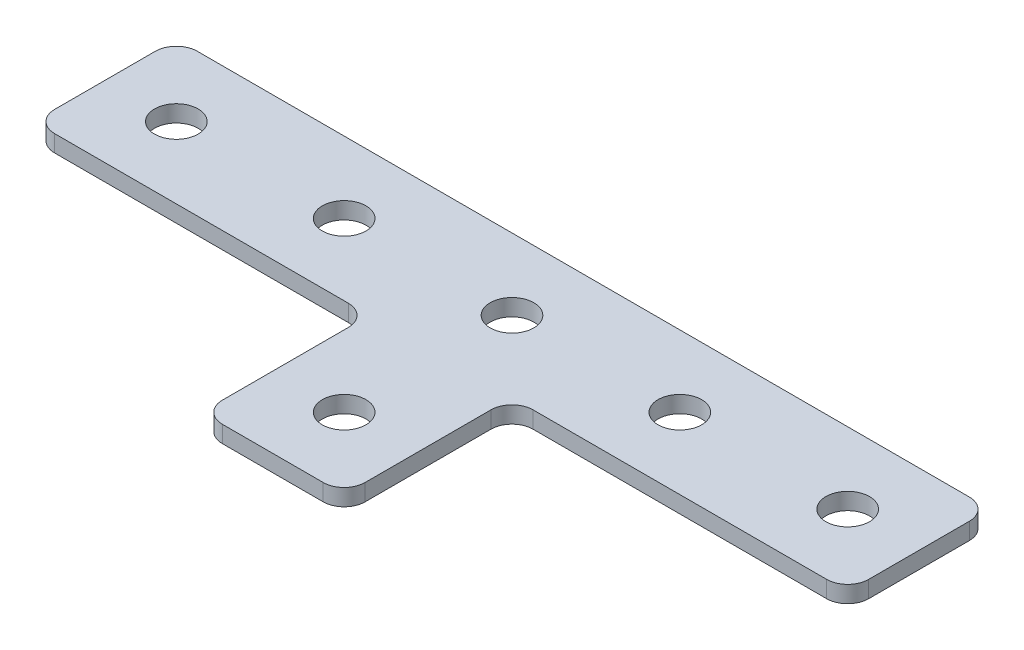
ISO-10303-21;
HEADER;
FILE_DESCRIPTION(('STEP AP214'),'2;1');
FILE_NAME('part.step','',(''),(''),'','','');
FILE_SCHEMA(('AUTOMOTIVE_DESIGN { 1 0 10303 214 1 1 1 1 }'));
ENDSEC;
DATA;
#1=APPLICATION_CONTEXT('core data for automotive mechanical design processes');
#2=APPLICATION_PROTOCOL_DEFINITION('international standard','automotive_design',2000,#1);
#3=PRODUCT_CONTEXT('',#1,'mechanical');
#4=PRODUCT('Part','Part','',(#3));
#5=PRODUCT_RELATED_PRODUCT_CATEGORY('part','',(#4));
#6=PRODUCT_DEFINITION_FORMATION('','',#4);
#7=PRODUCT_DEFINITION_CONTEXT('part definition',#1,'design');
#8=PRODUCT_DEFINITION('design','',#6,#7);
#9=PRODUCT_DEFINITION_SHAPE('','',#8);
#10=(LENGTH_UNIT() NAMED_UNIT(*) SI_UNIT(.MILLI.,.METRE.));
#11=(NAMED_UNIT(*) PLANE_ANGLE_UNIT() SI_UNIT($,.RADIAN.));
#12=(NAMED_UNIT(*) SI_UNIT($,.STERADIAN.) SOLID_ANGLE_UNIT());
#13=UNCERTAINTY_MEASURE_WITH_UNIT(LENGTH_MEASURE(1.E-05),#10,'distance_accuracy_value','');
#14=(GEOMETRIC_REPRESENTATION_CONTEXT(3) GLOBAL_UNCERTAINTY_ASSIGNED_CONTEXT((#13)) GLOBAL_UNIT_ASSIGNED_CONTEXT((#10,
#11,#12)) REPRESENTATION_CONTEXT('',''));
#15=CARTESIAN_POINT('',(0.,0.,0.));
#16=DIRECTION('',(0.,0.,1.));
#17=DIRECTION('',(1.,0.,0.));
#18=AXIS2_PLACEMENT_3D('',#15,#16,#17);
#19=CARTESIAN_POINT('',(-1.67011649585902,2.14126526075142,-11.4706382626172));
#20=DIRECTION('',(0.,-1.,0.));
#21=DIRECTION('',(0.,0.,-1.));
#22=AXIS2_PLACEMENT_3D('',#19,#20,#21);
#23=PLANE('',#22);
#24=CARTESIAN_POINT('',(-1.67011649585902,2.14126526075142,-11.4706382626172));
#25=DIRECTION('',(0.,1.,0.));
#26=DIRECTION('',(0.,0.,1.));
#27=AXIS2_PLACEMENT_3D('',#24,#25,#26);
#28=CIRCLE('',#27,2.6);
#29=CARTESIAN_POINT('',(-1.67011649585902,2.14126526075142,-8.87063826261725));
#30=VERTEX_POINT('',#29);
#31=EDGE_CURVE('E275',#30,#30,#28,.T.);
#32=ORIENTED_EDGE('',*,*,#31,.T.);
#33=EDGE_LOOP('',(#32));
#34=FACE_BOUND('',#33,.T.);
#35=DIRECTION('',(0.,0.,-1.));
#36=VECTOR('',#35,1.);
#37=CARTESIAN_POINT('',(6.82988350414104,2.14126526075142,17.0293617373827));
#38=LINE('',#37,#36);
#39=CARTESIAN_POINT('',(6.82988350414104,2.14126526075142,14.5293617373827));
#40=VERTEX_POINT('',#39);
#41=CARTESIAN_POINT('',(6.82988350414104,2.14126526075142,-0.470638262617212));
#42=VERTEX_POINT('',#41);
#43=EDGE_CURVE('E156',#40,#42,#38,.T.);
#44=ORIENTED_EDGE('',*,*,#43,.F.);
#45=CARTESIAN_POINT('',(4.32988350414104,2.14126526075142,14.5293617373827));
#46=DIRECTION('',(0.,-1.,0.));
#47=DIRECTION('',(0.,0.,-1.));
#48=AXIS2_PLACEMENT_3D('',#45,#46,#47);
#49=CIRCLE('',#48,2.5);
#50=CARTESIAN_POINT('',(4.32988350414104,2.14126526075142,17.0293617373827));
#51=VERTEX_POINT('',#50);
#52=EDGE_CURVE('E186',#40,#51,#49,.T.);
#53=ORIENTED_EDGE('',*,*,#52,.T.);
#54=DIRECTION('',(1.,0.,0.));
#55=VECTOR('',#54,1.);
#56=CARTESIAN_POINT('',(-10.1701164958591,2.14126526075142,17.0293617373827));
#57=LINE('',#56,#55);
#58=CARTESIAN_POINT('',(-7.67011649585907,2.14126526075142,17.0293617373827));
#59=VERTEX_POINT('',#58);
#60=EDGE_CURVE('E160',#59,#51,#57,.T.);
#61=ORIENTED_EDGE('',*,*,#60,.F.);
#62=CARTESIAN_POINT('',(-7.67011649585907,2.14126526075142,14.5293617373827));
#63=DIRECTION('',(0.,-1.,0.));
#64=DIRECTION('',(0.,0.,-1.));
#65=AXIS2_PLACEMENT_3D('',#62,#63,#64);
#66=CIRCLE('',#65,2.5);
#67=CARTESIAN_POINT('',(-10.1701164958591,2.14126526075142,14.5293617373827));
#68=VERTEX_POINT('',#67);
#69=EDGE_CURVE('E155',#59,#68,#66,.T.);
#70=ORIENTED_EDGE('',*,*,#69,.T.);
#71=DIRECTION('',(0.,0.,-1.));
#72=VECTOR('',#71,1.);
#73=CARTESIAN_POINT('',(-10.1701164958591,2.14126526075142,17.0293617373827));
#74=LINE('',#73,#72);
#75=CARTESIAN_POINT('',(-10.1701164958591,2.14126526075142,-0.470638262617208));
#76=VERTEX_POINT('',#75);
#77=EDGE_CURVE('E239',#68,#76,#74,.T.);
#78=ORIENTED_EDGE('',*,*,#77,.T.);
#79=CARTESIAN_POINT('',(-12.6701164958591,2.14126526075142,-0.47063826261721));
#80=DIRECTION('',(0.,-1.,0.));
#81=DIRECTION('',(0.,0.,-1.));
#82=AXIS2_PLACEMENT_3D('',#79,#80,#81);
#83=CIRCLE('',#82,2.5);
#84=CARTESIAN_POINT('',(-12.6701164958591,2.14126526075142,-2.97063826261721));
#85=VERTEX_POINT('',#84);
#86=EDGE_CURVE('E10',#76,#85,#83,.F.);
#87=ORIENTED_EDGE('',*,*,#86,.T.);
#88=DIRECTION('',(-1.,0.,0.));
#89=VECTOR('',#88,1.);
#90=CARTESIAN_POINT('',(-10.1701164958591,2.14126526075142,-2.97063826261721));
#91=LINE('',#90,#89);
#92=CARTESIAN_POINT('',(-47.6701164958589,2.14126526075142,-2.9706382626172));
#93=VERTEX_POINT('',#92);
#94=EDGE_CURVE('E229',#85,#93,#91,.T.);
#95=ORIENTED_EDGE('',*,*,#94,.T.);
#96=CARTESIAN_POINT('',(-47.6701164958589,2.14126526075142,-5.4706382626172));
#97=DIRECTION('',(0.,-1.,0.));
#98=DIRECTION('',(0.,0.,-1.));
#99=AXIS2_PLACEMENT_3D('',#96,#97,#98);
#100=CIRCLE('',#99,2.5);
#101=CARTESIAN_POINT('',(-50.1701164958589,2.14126526075142,-5.4706382626172));
#102=VERTEX_POINT('',#101);
#103=EDGE_CURVE('E179',#93,#102,#100,.T.);
#104=ORIENTED_EDGE('',*,*,#103,.T.);
#105=DIRECTION('',(0.,0.,-1.));
#106=VECTOR('',#105,1.);
#107=CARTESIAN_POINT('',(-50.1701164958589,2.14126526075142,-2.9706382626172));
#108=LINE('',#107,#106);
#109=CARTESIAN_POINT('',(-50.170116495859,2.14126526075142,-17.4706382626173));
#110=VERTEX_POINT('',#109);
#111=EDGE_CURVE('E243',#102,#110,#108,.T.);
#112=ORIENTED_EDGE('',*,*,#111,.T.);
#113=CARTESIAN_POINT('',(-47.670116495859,2.14126526075142,-17.4706382626173));
#114=DIRECTION('',(0.,-1.,0.));
#115=DIRECTION('',(0.,0.,-1.));
#116=AXIS2_PLACEMENT_3D('',#113,#114,#115);
#117=CIRCLE('',#116,2.5);
#118=CARTESIAN_POINT('',(-47.670116495859,2.14126526075142,-19.9706382626173));
#119=VERTEX_POINT('',#118);
#120=EDGE_CURVE('E181',#110,#119,#117,.T.);
#121=ORIENTED_EDGE('',*,*,#120,.T.);
#122=DIRECTION('',(-1.,0.,0.));
#123=VECTOR('',#122,1.);
#124=CARTESIAN_POINT('',(46.8298835041409,2.14126526075142,-19.9706382626173));
#125=LINE('',#124,#123);
#126=CARTESIAN_POINT('',(44.3298835041409,2.14126526075142,-19.9706382626173));
#127=VERTEX_POINT('',#126);
#128=EDGE_CURVE('E286',#127,#119,#125,.T.);
#129=ORIENTED_EDGE('',*,*,#128,.F.);
#130=CARTESIAN_POINT('',(44.3298835041409,2.14126526075142,-17.4706382626173));
#131=DIRECTION('',(0.,-1.,0.));
#132=DIRECTION('',(0.,0.,-1.));
#133=AXIS2_PLACEMENT_3D('',#130,#131,#132);
#134=CIRCLE('',#133,2.5);
#135=CARTESIAN_POINT('',(46.8298835041409,2.14126526075142,-17.4706382626173));
#136=VERTEX_POINT('',#135);
#137=EDGE_CURVE('E183',#127,#136,#134,.T.);
#138=ORIENTED_EDGE('',*,*,#137,.T.);
#139=DIRECTION('',(0.,0.,-1.));
#140=VECTOR('',#139,1.);
#141=CARTESIAN_POINT('',(46.8298835041409,2.14126526075142,-2.97063826261721));
#142=LINE('',#141,#140);
#143=CARTESIAN_POINT('',(46.8298835041409,2.14126526075142,-5.47063826261721));
#144=VERTEX_POINT('',#143);
#145=EDGE_CURVE('E283',#144,#136,#142,.T.);
#146=ORIENTED_EDGE('',*,*,#145,.F.);
#147=CARTESIAN_POINT('',(44.3298835041409,2.14126526075142,-5.47063826261721));
#148=DIRECTION('',(0.,-1.,0.));
#149=DIRECTION('',(0.,0.,-1.));
#150=AXIS2_PLACEMENT_3D('',#147,#148,#149);
#151=CIRCLE('',#150,2.5);
#152=CARTESIAN_POINT('',(44.3298835041409,2.14126526075142,-2.97063826261721));
#153=VERTEX_POINT('',#152);
#154=EDGE_CURVE('E31',#144,#153,#151,.T.);
#155=ORIENTED_EDGE('',*,*,#154,.T.);
#156=DIRECTION('',(1.,0.,0.));
#157=VECTOR('',#156,1.);
#158=CARTESIAN_POINT('',(6.82988350414104,2.14126526075142,-2.97063826261721));
#159=LINE('',#158,#157);
#160=CARTESIAN_POINT('',(9.32988350414104,2.14126526075142,-2.97063826261721));
#161=VERTEX_POINT('',#160);
#162=EDGE_CURVE('E281',#161,#153,#159,.T.);
#163=ORIENTED_EDGE('',*,*,#162,.F.);
#164=CARTESIAN_POINT('',(9.32988350414104,2.14126526075142,-0.470638262617212));
#165=DIRECTION('',(0.,-1.,0.));
#166=DIRECTION('',(0.,0.,-1.));
#167=AXIS2_PLACEMENT_3D('',#164,#165,#166);
#168=CIRCLE('',#167,2.5);
#169=EDGE_CURVE('E218',#161,#42,#168,.F.);
#170=ORIENTED_EDGE('',*,*,#169,.T.);
#171=EDGE_LOOP('',(#44,#53,#61,#70,#78,#87,#95,#104,#112,#121,#129,#138,#146,#155,#163,#170));
#172=FACE_BOUND('',#171,.T.);
#173=CARTESIAN_POINT('',(-1.67011649585903,2.14126526075142,8.52936173738276));
#174=DIRECTION('',(0.,1.,0.));
#175=DIRECTION('',(0.,0.,1.));
#176=AXIS2_PLACEMENT_3D('',#173,#174,#175);
#177=CIRCLE('',#176,2.6);
#178=CARTESIAN_POINT('',(-1.67011649585903,2.14126526075142,11.1293617373828));
#179=VERTEX_POINT('',#178);
#180=EDGE_CURVE('E263',#179,#179,#177,.T.);
#181=ORIENTED_EDGE('',*,*,#180,.T.);
#182=EDGE_LOOP('',(#181));
#183=FACE_BOUND('',#182,.T.);
#184=CARTESIAN_POINT('',(38.329883504141,2.14126526075142,-11.4706382626172));
#185=DIRECTION('',(0.,1.,0.));
#186=DIRECTION('',(0.,0.,1.));
#187=AXIS2_PLACEMENT_3D('',#184,#185,#186);
#188=CIRCLE('',#187,2.6);
#189=CARTESIAN_POINT('',(38.329883504141,2.14126526075142,-8.87063826261725));
#190=VERTEX_POINT('',#189);
#191=EDGE_CURVE('E257',#190,#190,#188,.T.);
#192=ORIENTED_EDGE('',*,*,#191,.T.);
#193=EDGE_LOOP('',(#192));
#194=FACE_BOUND('',#193,.T.);
#195=CARTESIAN_POINT('',(18.329883504141,2.14126526075142,-11.4706382626172));
#196=DIRECTION('',(0.,1.,0.));
#197=DIRECTION('',(0.,0.,1.));
#198=AXIS2_PLACEMENT_3D('',#195,#196,#197);
#199=CIRCLE('',#198,2.6);
#200=CARTESIAN_POINT('',(18.329883504141,2.14126526075142,-8.87063826261724));
#201=VERTEX_POINT('',#200);
#202=EDGE_CURVE('E269',#201,#201,#199,.T.);
#203=ORIENTED_EDGE('',*,*,#202,.T.);
#204=EDGE_LOOP('',(#203));
#205=FACE_BOUND('',#204,.T.);
#206=CARTESIAN_POINT('',(-41.670116495859,2.14126526075142,-11.4706382626172));
#207=DIRECTION('',(0.,-1.,0.));
#208=DIRECTION('',(0.,0.,1.));
#209=AXIS2_PLACEMENT_3D('',#206,#207,#208);
#210=CIRCLE('',#209,2.6);
#211=CARTESIAN_POINT('',(-41.670116495859,2.14126526075142,-8.87063826261724));
#212=VERTEX_POINT('',#211);
#213=EDGE_CURVE('E392',#212,#212,#210,.T.);
#214=ORIENTED_EDGE('',*,*,#213,.F.);
#215=EDGE_LOOP('',(#214));
#216=FACE_BOUND('',#215,.T.);
#217=CARTESIAN_POINT('',(-21.670116495859,2.14126526075142,-11.4706382626172));
#218=DIRECTION('',(0.,-1.,0.));
#219=DIRECTION('',(0.,0.,1.));
#220=AXIS2_PLACEMENT_3D('',#217,#218,#219);
#221=CIRCLE('',#220,2.6);
#222=CARTESIAN_POINT('',(-21.670116495859,2.14126526075142,-8.87063826261723));
#223=VERTEX_POINT('',#222);
#224=EDGE_CURVE('E254',#223,#223,#221,.T.);
#225=ORIENTED_EDGE('',*,*,#224,.F.);
#226=EDGE_LOOP('',(#225));
#227=FACE_BOUND('',#226,.T.);
#228=ADVANCED_FACE('F16',(#34,#172,#183,#194,#205,#216,#227),#23,.T.);
#229=CARTESIAN_POINT('',(6.82988350414104,2.14126526075142,-2.97063826261721));
#230=DIRECTION('',(0.,0.,1.));
#231=DIRECTION('',(1.,0.,0.));
#232=AXIS2_PLACEMENT_3D('',#229,#230,#231);
#233=PLANE('',#232);
#234=DIRECTION('',(1.,0.,0.));
#235=VECTOR('',#234,1.);
#236=CARTESIAN_POINT('',(6.82988350414104,4.14126526075142,-2.97063826261721));
#237=LINE('',#236,#235);
#238=CARTESIAN_POINT('',(9.32988350414104,4.14126526075142,-2.97063826261721));
#239=VERTEX_POINT('',#238);
#240=CARTESIAN_POINT('',(44.3298835041409,4.14126526075142,-2.97063826261721));
#241=VERTEX_POINT('',#240);
#242=EDGE_CURVE('E278',#239,#241,#237,.T.);
#243=ORIENTED_EDGE('',*,*,#242,.F.);
#244=DIRECTION('',(0.,1.,0.));
#245=VECTOR('',#244,1.);
#246=CARTESIAN_POINT('',(9.32988350414104,2.14126526075142,-2.97063826261721));
#247=LINE('',#246,#245);
#248=EDGE_CURVE('E38',#239,#161,#247,.F.);
#249=ORIENTED_EDGE('',*,*,#248,.T.);
#250=ORIENTED_EDGE('',*,*,#162,.T.);
#251=DIRECTION('',(0.,1.,0.));
#252=VECTOR('',#251,1.);
#253=CARTESIAN_POINT('',(44.3298835041409,2.14126526075142,-2.97063826261721));
#254=LINE('',#253,#252);
#255=EDGE_CURVE('E188',#153,#241,#254,.T.);
#256=ORIENTED_EDGE('',*,*,#255,.T.);
#257=EDGE_LOOP('',(#243,#249,#250,#256));
#258=FACE_BOUND('',#257,.T.);
#259=ADVANCED_FACE('F314',(#258),#233,.T.);
#260=CARTESIAN_POINT('',(6.82988350414104,2.14126526075142,17.0293617373827));
#261=DIRECTION('',(1.,0.,0.));
#262=DIRECTION('',(0.,0.,-1.));
#263=AXIS2_PLACEMENT_3D('',#260,#261,#262);
#264=PLANE('',#263);
#265=DIRECTION('',(0.,0.,-1.));
#266=VECTOR('',#265,1.);
#267=CARTESIAN_POINT('',(6.82988350414104,4.14126526075142,17.0293617373827));
#268=LINE('',#267,#266);
#269=CARTESIAN_POINT('',(6.82988350414104,4.14126526075142,14.5293617373827));
#270=VERTEX_POINT('',#269);
#271=CARTESIAN_POINT('',(6.82988350414104,4.14126526075142,-0.470638262617212));
#272=VERTEX_POINT('',#271);
#273=EDGE_CURVE('E151',#270,#272,#268,.T.);
#274=ORIENTED_EDGE('',*,*,#273,.F.);
#275=DIRECTION('',(0.,1.,0.));
#276=VECTOR('',#275,1.);
#277=CARTESIAN_POINT('',(6.82988350414104,2.14126526075142,14.5293617373827));
#278=LINE('',#277,#276);
#279=EDGE_CURVE('E176',#270,#40,#278,.F.);
#280=ORIENTED_EDGE('',*,*,#279,.T.);
#281=ORIENTED_EDGE('',*,*,#43,.T.);
#282=DIRECTION('',(0.,1.,0.));
#283=VECTOR('',#282,1.);
#284=CARTESIAN_POINT('',(6.82988350414104,4.14126526075142,-0.470638262617212));
#285=LINE('',#284,#283);
#286=EDGE_CURVE('E173',#42,#272,#285,.T.);
#287=ORIENTED_EDGE('',*,*,#286,.T.);
#288=EDGE_LOOP('',(#274,#280,#281,#287));
#289=FACE_BOUND('',#288,.T.);
#290=ADVANCED_FACE('F322',(#289),#264,.T.);
#291=CARTESIAN_POINT('',(-10.1701164958591,2.14126526075142,17.0293617373827));
#292=DIRECTION('',(0.,0.,1.));
#293=DIRECTION('',(1.,0.,0.));
#294=AXIS2_PLACEMENT_3D('',#291,#292,#293);
#295=PLANE('',#294);
#296=ORIENTED_EDGE('',*,*,#60,.T.);
#297=DIRECTION('',(0.,1.,0.));
#298=VECTOR('',#297,1.);
#299=CARTESIAN_POINT('',(4.32988350414104,2.14126526075142,17.0293617373827));
#300=LINE('',#299,#298);
#301=CARTESIAN_POINT('',(4.32988350414104,4.14126526075142,17.0293617373827));
#302=VERTEX_POINT('',#301);
#303=EDGE_CURVE('E142',#51,#302,#300,.T.);
#304=ORIENTED_EDGE('',*,*,#303,.T.);
#305=DIRECTION('',(1.,0.,0.));
#306=VECTOR('',#305,1.);
#307=CARTESIAN_POINT('',(-10.1701164958591,4.14126526075142,17.0293617373827));
#308=LINE('',#307,#306);
#309=CARTESIAN_POINT('',(-7.67011649585907,4.14126526075142,17.0293617373827));
#310=VERTEX_POINT('',#309);
#311=EDGE_CURVE('E134',#310,#302,#308,.T.);
#312=ORIENTED_EDGE('',*,*,#311,.F.);
#313=DIRECTION('',(0.,1.,0.));
#314=VECTOR('',#313,1.);
#315=CARTESIAN_POINT('',(-7.67011649585907,2.14126526075142,17.0293617373827));
#316=LINE('',#315,#314);
#317=EDGE_CURVE('E148',#310,#59,#316,.F.);
#318=ORIENTED_EDGE('',*,*,#317,.T.);
#319=EDGE_LOOP('',(#296,#304,#312,#318));
#320=FACE_BOUND('',#319,.T.);
#321=ADVANCED_FACE('F147',(#320),#295,.T.);
#322=CARTESIAN_POINT('',(46.8298835041409,2.14126526075142,-19.9706382626173));
#323=DIRECTION('',(0.,0.,-1.));
#324=DIRECTION('',(-1.,0.,0.));
#325=AXIS2_PLACEMENT_3D('',#322,#323,#324);
#326=PLANE('',#325);
#327=DIRECTION('',(-1.,0.,0.));
#328=VECTOR('',#327,1.);
#329=CARTESIAN_POINT('',(46.8298835041409,4.14126526075142,-19.9706382626173));
#330=LINE('',#329,#328);
#331=CARTESIAN_POINT('',(44.3298835041409,4.14126526075142,-19.9706382626173));
#332=VERTEX_POINT('',#331);
#333=CARTESIAN_POINT('',(-47.670116495859,4.14126526075142,-19.9706382626173));
#334=VERTEX_POINT('',#333);
#335=EDGE_CURVE('E152',#332,#334,#330,.T.);
#336=ORIENTED_EDGE('',*,*,#335,.F.);
#337=DIRECTION('',(0.,1.,0.));
#338=VECTOR('',#337,1.);
#339=CARTESIAN_POINT('',(44.3298835041409,2.14126526075142,-19.9706382626173));
#340=LINE('',#339,#338);
#341=EDGE_CURVE('E200',#332,#127,#340,.F.);
#342=ORIENTED_EDGE('',*,*,#341,.T.);
#343=ORIENTED_EDGE('',*,*,#128,.T.);
#344=DIRECTION('',(0.,1.,0.));
#345=VECTOR('',#344,1.);
#346=CARTESIAN_POINT('',(-47.670116495859,2.14126526075142,-19.9706382626173));
#347=LINE('',#346,#345);
#348=EDGE_CURVE('E197',#119,#334,#347,.T.);
#349=ORIENTED_EDGE('',*,*,#348,.T.);
#350=EDGE_LOOP('',(#336,#342,#343,#349));
#351=FACE_BOUND('',#350,.T.);
#352=ADVANCED_FACE('F300',(#351),#326,.T.);
#353=CARTESIAN_POINT('',(46.8298835041409,2.14126526075142,-2.97063826261721));
#354=DIRECTION('',(1.,0.,0.));
#355=DIRECTION('',(0.,0.,-1.));
#356=AXIS2_PLACEMENT_3D('',#353,#354,#355);
#357=PLANE('',#356);
#358=DIRECTION('',(0.,0.,-1.));
#359=VECTOR('',#358,1.);
#360=CARTESIAN_POINT('',(46.8298835041409,4.14126526075142,-2.97063826261721));
#361=LINE('',#360,#359);
#362=CARTESIAN_POINT('',(46.8298835041409,4.14126526075142,-5.47063826261721));
#363=VERTEX_POINT('',#362);
#364=CARTESIAN_POINT('',(46.8298835041409,4.14126526075142,-17.4706382626173));
#365=VERTEX_POINT('',#364);
#366=EDGE_CURVE('E292',#363,#365,#361,.T.);
#367=ORIENTED_EDGE('',*,*,#366,.F.);
#368=DIRECTION('',(0.,1.,0.));
#369=VECTOR('',#368,1.);
#370=CARTESIAN_POINT('',(46.8298835041409,2.14126526075142,-5.47063826261721));
#371=LINE('',#370,#369);
#372=EDGE_CURVE('E195',#363,#144,#371,.F.);
#373=ORIENTED_EDGE('',*,*,#372,.T.);
#374=ORIENTED_EDGE('',*,*,#145,.T.);
#375=DIRECTION('',(0.,1.,0.));
#376=VECTOR('',#375,1.);
#377=CARTESIAN_POINT('',(46.8298835041409,2.14126526075142,-17.4706382626173));
#378=LINE('',#377,#376);
#379=EDGE_CURVE('E192',#136,#365,#378,.T.);
#380=ORIENTED_EDGE('',*,*,#379,.T.);
#381=EDGE_LOOP('',(#367,#373,#374,#380));
#382=FACE_BOUND('',#381,.T.);
#383=ADVANCED_FACE('F309',(#382),#357,.T.);
#384=CARTESIAN_POINT('',(-1.67011649585902,4.14126526075142,-11.4706382626172));
#385=DIRECTION('',(0.,-1.,0.));
#386=DIRECTION('',(0.,0.,-1.));
#387=AXIS2_PLACEMENT_3D('',#384,#385,#386);
#388=PLANE('',#387);
#389=CARTESIAN_POINT('',(-1.67011649585902,4.14126526075142,-11.4706382626172));
#390=DIRECTION('',(0.,1.,0.));
#391=DIRECTION('',(0.,0.,1.));
#392=AXIS2_PLACEMENT_3D('',#389,#390,#391);
#393=CIRCLE('',#392,2.6);
#394=CARTESIAN_POINT('',(-1.67011649585902,4.14126526075142,-8.87063826261725));
#395=VERTEX_POINT('',#394);
#396=EDGE_CURVE('E272',#395,#395,#393,.T.);
#397=ORIENTED_EDGE('',*,*,#396,.F.);
#398=EDGE_LOOP('',(#397));
#399=FACE_BOUND('',#398,.T.);
#400=ORIENTED_EDGE('',*,*,#311,.T.);
#401=CARTESIAN_POINT('',(4.32988350414104,4.14126526075142,14.5293617373827));
#402=DIRECTION('',(0.,-1.,0.));
#403=DIRECTION('',(0.,0.,-1.));
#404=AXIS2_PLACEMENT_3D('',#401,#402,#403);
#405=CIRCLE('',#404,2.5);
#406=EDGE_CURVE('E171',#302,#270,#405,.F.);
#407=ORIENTED_EDGE('',*,*,#406,.T.);
#408=ORIENTED_EDGE('',*,*,#273,.T.);
#409=CARTESIAN_POINT('',(9.32988350414104,4.14126526075142,-0.470638262617212));
#410=DIRECTION('',(0.,-1.,0.));
#411=DIRECTION('',(0.,0.,-1.));
#412=AXIS2_PLACEMENT_3D('',#409,#410,#411);
#413=CIRCLE('',#412,2.5);
#414=EDGE_CURVE('E216',#272,#239,#413,.T.);
#415=ORIENTED_EDGE('',*,*,#414,.T.);
#416=ORIENTED_EDGE('',*,*,#242,.T.);
#417=CARTESIAN_POINT('',(44.3298835041409,4.14126526075142,-5.47063826261721));
#418=DIRECTION('',(0.,-1.,0.));
#419=DIRECTION('',(0.,0.,-1.));
#420=AXIS2_PLACEMENT_3D('',#417,#418,#419);
#421=CIRCLE('',#420,2.5);
#422=EDGE_CURVE('E169',#241,#363,#421,.F.);
#423=ORIENTED_EDGE('',*,*,#422,.T.);
#424=ORIENTED_EDGE('',*,*,#366,.T.);
#425=CARTESIAN_POINT('',(44.3298835041409,4.14126526075142,-17.4706382626173));
#426=DIRECTION('',(0.,-1.,0.));
#427=DIRECTION('',(0.,0.,-1.));
#428=AXIS2_PLACEMENT_3D('',#425,#426,#427);
#429=CIRCLE('',#428,2.5);
#430=EDGE_CURVE('E167',#365,#332,#429,.F.);
#431=ORIENTED_EDGE('',*,*,#430,.T.);
#432=ORIENTED_EDGE('',*,*,#335,.T.);
#433=CARTESIAN_POINT('',(-47.670116495859,4.14126526075142,-17.4706382626173));
#434=DIRECTION('',(0.,-1.,0.));
#435=DIRECTION('',(0.,0.,-1.));
#436=AXIS2_PLACEMENT_3D('',#433,#434,#435);
#437=CIRCLE('',#436,2.5);
#438=CARTESIAN_POINT('',(-50.170116495859,4.14126526075142,-17.4706382626173));
#439=VERTEX_POINT('',#438);
#440=EDGE_CURVE('E165',#334,#439,#437,.F.);
#441=ORIENTED_EDGE('',*,*,#440,.T.);
#442=DIRECTION('',(0.,0.,-1.));
#443=VECTOR('',#442,1.);
#444=CARTESIAN_POINT('',(-50.1701164958589,4.14126526075142,-2.9706382626172));
#445=LINE('',#444,#443);
#446=CARTESIAN_POINT('',(-50.1701164958589,4.14126526075142,-5.4706382626172));
#447=VERTEX_POINT('',#446);
#448=EDGE_CURVE('E230',#447,#439,#445,.T.);
#449=ORIENTED_EDGE('',*,*,#448,.F.);
#450=CARTESIAN_POINT('',(-47.6701164958589,4.14126526075142,-5.4706382626172));
#451=DIRECTION('',(0.,-1.,0.));
#452=DIRECTION('',(0.,0.,-1.));
#453=AXIS2_PLACEMENT_3D('',#450,#451,#452);
#454=CIRCLE('',#453,2.5);
#455=CARTESIAN_POINT('',(-47.6701164958589,4.14126526075142,-2.9706382626172));
#456=VERTEX_POINT('',#455);
#457=EDGE_CURVE('E141',#447,#456,#454,.F.);
#458=ORIENTED_EDGE('',*,*,#457,.T.);
#459=DIRECTION('',(-1.,0.,0.));
#460=VECTOR('',#459,1.);
#461=CARTESIAN_POINT('',(-10.1701164958591,4.14126526075142,-2.97063826261721));
#462=LINE('',#461,#460);
#463=CARTESIAN_POINT('',(-12.6701164958591,4.14126526075142,-2.97063826261721));
#464=VERTEX_POINT('',#463);
#465=EDGE_CURVE('E221',#464,#456,#462,.T.);
#466=ORIENTED_EDGE('',*,*,#465,.F.);
#467=CARTESIAN_POINT('',(-12.6701164958591,4.14126526075142,-0.47063826261721));
#468=DIRECTION('',(0.,-1.,0.));
#469=DIRECTION('',(0.,0.,-1.));
#470=AXIS2_PLACEMENT_3D('',#467,#468,#469);
#471=CIRCLE('',#470,2.5);
#472=CARTESIAN_POINT('',(-10.1701164958591,4.14126526075142,-0.470638262617208));
#473=VERTEX_POINT('',#472);
#474=EDGE_CURVE('E24',#464,#473,#471,.T.);
#475=ORIENTED_EDGE('',*,*,#474,.T.);
#476=DIRECTION('',(0.,0.,-1.));
#477=VECTOR('',#476,1.);
#478=CARTESIAN_POINT('',(-10.1701164958591,4.14126526075142,17.0293617373827));
#479=LINE('',#478,#477);
#480=CARTESIAN_POINT('',(-10.1701164958591,4.14126526075142,14.5293617373827));
#481=VERTEX_POINT('',#480);
#482=EDGE_CURVE('E136',#481,#473,#479,.T.);
#483=ORIENTED_EDGE('',*,*,#482,.F.);
#484=CARTESIAN_POINT('',(-7.67011649585907,4.14126526075142,14.5293617373827));
#485=DIRECTION('',(0.,-1.,0.));
#486=DIRECTION('',(0.,0.,-1.));
#487=AXIS2_PLACEMENT_3D('',#484,#485,#486);
#488=CIRCLE('',#487,2.5);
#489=EDGE_CURVE('E130',#481,#310,#488,.F.);
#490=ORIENTED_EDGE('',*,*,#489,.T.);
#491=EDGE_LOOP('',(#400,#407,#408,#415,#416,#423,#424,#431,#432,#441,#449,#458,#466,#475,#483,#490));
#492=FACE_BOUND('',#491,.T.);
#493=CARTESIAN_POINT('',(38.329883504141,4.14126526075142,-11.4706382626172));
#494=DIRECTION('',(0.,1.,0.));
#495=DIRECTION('',(0.,0.,1.));
#496=AXIS2_PLACEMENT_3D('',#493,#494,#495);
#497=CIRCLE('',#496,2.6);
#498=CARTESIAN_POINT('',(38.329883504141,4.14126526075142,-8.87063826261725));
#499=VERTEX_POINT('',#498);
#500=EDGE_CURVE('E252',#499,#499,#497,.T.);
#501=ORIENTED_EDGE('',*,*,#500,.F.);
#502=EDGE_LOOP('',(#501));
#503=FACE_BOUND('',#502,.T.);
#504=CARTESIAN_POINT('',(18.329883504141,4.14126526075142,-11.4706382626172));
#505=DIRECTION('',(0.,1.,0.));
#506=DIRECTION('',(0.,0.,1.));
#507=AXIS2_PLACEMENT_3D('',#504,#505,#506);
#508=CIRCLE('',#507,2.6);
#509=CARTESIAN_POINT('',(18.329883504141,4.14126526075142,-8.87063826261724));
#510=VERTEX_POINT('',#509);
#511=EDGE_CURVE('E266',#510,#510,#508,.T.);
#512=ORIENTED_EDGE('',*,*,#511,.F.);
#513=EDGE_LOOP('',(#512));
#514=FACE_BOUND('',#513,.T.);
#515=CARTESIAN_POINT('',(-1.67011649585903,4.14126526075142,8.52936173738276));
#516=DIRECTION('',(0.,1.,0.));
#517=DIRECTION('',(0.,0.,1.));
#518=AXIS2_PLACEMENT_3D('',#515,#516,#517);
#519=CIRCLE('',#518,2.6);
#520=CARTESIAN_POINT('',(-1.67011649585903,4.14126526075142,11.1293617373828));
#521=VERTEX_POINT('',#520);
#522=EDGE_CURVE('E260',#521,#521,#519,.T.);
#523=ORIENTED_EDGE('',*,*,#522,.F.);
#524=EDGE_LOOP('',(#523));
#525=FACE_BOUND('',#524,.T.);
#526=CARTESIAN_POINT('',(-41.670116495859,4.14126526075142,-11.4706382626172));
#527=DIRECTION('',(0.,-1.,0.));
#528=DIRECTION('',(0.,0.,1.));
#529=AXIS2_PLACEMENT_3D('',#526,#527,#528);
#530=CIRCLE('',#529,2.6);
#531=CARTESIAN_POINT('',(-41.670116495859,4.14126526075142,-8.87063826261724));
#532=VERTEX_POINT('',#531);
#533=EDGE_CURVE('E394',#532,#532,#530,.T.);
#534=ORIENTED_EDGE('',*,*,#533,.T.);
#535=EDGE_LOOP('',(#534));
#536=FACE_BOUND('',#535,.T.);
#537=CARTESIAN_POINT('',(-21.670116495859,4.14126526075142,-11.4706382626172));
#538=DIRECTION('',(0.,-1.,0.));
#539=DIRECTION('',(0.,0.,1.));
#540=AXIS2_PLACEMENT_3D('',#537,#538,#539);
#541=CIRCLE('',#540,2.6);
#542=CARTESIAN_POINT('',(-21.670116495859,4.14126526075142,-8.87063826261723));
#543=VERTEX_POINT('',#542);
#544=EDGE_CURVE('E248',#543,#543,#541,.T.);
#545=ORIENTED_EDGE('',*,*,#544,.T.);
#546=EDGE_LOOP('',(#545));
#547=FACE_BOUND('',#546,.T.);
#548=ADVANCED_FACE('F132',(#399,#492,#503,#514,#525,#536,#547),#388,.F.);
#549=CARTESIAN_POINT('',(-1.67011649585902,2.14126526075142,-11.4706382626172));
#550=DIRECTION('',(0.,1.,0.));
#551=DIRECTION('',(0.,0.,1.));
#552=AXIS2_PLACEMENT_3D('',#549,#550,#551);
#553=CYLINDRICAL_SURFACE('',#552,2.6);
#554=ORIENTED_EDGE('',*,*,#31,.F.);
#555=EDGE_LOOP('',(#554));
#556=FACE_BOUND('',#555,.T.);
#557=ORIENTED_EDGE('',*,*,#396,.T.);
#558=EDGE_LOOP('',(#557));
#559=FACE_BOUND('',#558,.T.);
#560=ADVANCED_FACE('F348',(#556,#559),#553,.F.);
#561=CARTESIAN_POINT('',(18.329883504141,2.14126526075142,-11.4706382626172));
#562=DIRECTION('',(0.,1.,0.));
#563=DIRECTION('',(0.,0.,1.));
#564=AXIS2_PLACEMENT_3D('',#561,#562,#563);
#565=CYLINDRICAL_SURFACE('',#564,2.6);
#566=ORIENTED_EDGE('',*,*,#202,.F.);
#567=EDGE_LOOP('',(#566));
#568=FACE_BOUND('',#567,.T.);
#569=ORIENTED_EDGE('',*,*,#511,.T.);
#570=EDGE_LOOP('',(#569));
#571=FACE_BOUND('',#570,.T.);
#572=ADVANCED_FACE('F361',(#568,#571),#565,.F.);
#573=CARTESIAN_POINT('',(-1.67011649585903,2.14126526075142,8.52936173738276));
#574=DIRECTION('',(0.,1.,0.));
#575=DIRECTION('',(0.,0.,1.));
#576=AXIS2_PLACEMENT_3D('',#573,#574,#575);
#577=CYLINDRICAL_SURFACE('',#576,2.6);
#578=ORIENTED_EDGE('',*,*,#522,.T.);
#579=EDGE_LOOP('',(#578));
#580=FACE_BOUND('',#579,.T.);
#581=ORIENTED_EDGE('',*,*,#180,.F.);
#582=EDGE_LOOP('',(#581));
#583=FACE_BOUND('',#582,.T.);
#584=ADVANCED_FACE('F365',(#580,#583),#577,.F.);
#585=CARTESIAN_POINT('',(38.329883504141,2.14126526075142,-11.4706382626172));
#586=DIRECTION('',(0.,1.,0.));
#587=DIRECTION('',(0.,0.,1.));
#588=AXIS2_PLACEMENT_3D('',#585,#586,#587);
#589=CYLINDRICAL_SURFACE('',#588,2.6);
#590=ORIENTED_EDGE('',*,*,#191,.F.);
#591=EDGE_LOOP('',(#590));
#592=FACE_BOUND('',#591,.T.);
#593=ORIENTED_EDGE('',*,*,#500,.T.);
#594=EDGE_LOOP('',(#593));
#595=FACE_BOUND('',#594,.T.);
#596=ADVANCED_FACE('F369',(#592,#595),#589,.F.);
#597=CARTESIAN_POINT('',(-10.1701164958591,2.14126526075142,-2.97063826261721));
#598=DIRECTION('',(0.,0.,1.));
#599=DIRECTION('',(-1.,0.,0.));
#600=AXIS2_PLACEMENT_3D('',#597,#598,#599);
#601=PLANE('',#600);
#602=ORIENTED_EDGE('',*,*,#465,.T.);
#603=DIRECTION('',(0.,1.,0.));
#604=VECTOR('',#603,1.);
#605=CARTESIAN_POINT('',(-47.6701164958589,2.14126526075142,-2.9706382626172));
#606=LINE('',#605,#604);
#607=EDGE_CURVE('E210',#456,#93,#606,.F.);
#608=ORIENTED_EDGE('',*,*,#607,.T.);
#609=ORIENTED_EDGE('',*,*,#94,.F.);
#610=DIRECTION('',(0.,1.,0.));
#611=VECTOR('',#610,1.);
#612=CARTESIAN_POINT('',(-12.6701164958591,4.14126526075142,-2.97063826261721));
#613=LINE('',#612,#611);
#614=EDGE_CURVE('E207',#85,#464,#613,.T.);
#615=ORIENTED_EDGE('',*,*,#614,.T.);
#616=EDGE_LOOP('',(#602,#608,#609,#615));
#617=FACE_BOUND('',#616,.T.);
#618=ADVANCED_FACE('F241',(#617),#601,.T.);
#619=CARTESIAN_POINT('',(-10.1701164958591,2.14126526075142,17.0293617373827));
#620=DIRECTION('',(-1.,0.,0.));
#621=DIRECTION('',(0.,0.,-1.));
#622=AXIS2_PLACEMENT_3D('',#619,#620,#621);
#623=PLANE('',#622);
#624=ORIENTED_EDGE('',*,*,#482,.T.);
#625=DIRECTION('',(0.,1.,0.));
#626=VECTOR('',#625,1.);
#627=CARTESIAN_POINT('',(-10.1701164958591,2.14126526075142,-0.47063826261721));
#628=LINE('',#627,#626);
#629=EDGE_CURVE('E214',#473,#76,#628,.F.);
#630=ORIENTED_EDGE('',*,*,#629,.T.);
#631=ORIENTED_EDGE('',*,*,#77,.F.);
#632=DIRECTION('',(0.,1.,0.));
#633=VECTOR('',#632,1.);
#634=CARTESIAN_POINT('',(-10.1701164958591,2.14126526075142,14.5293617373827));
#635=LINE('',#634,#633);
#636=EDGE_CURVE('E212',#68,#481,#635,.T.);
#637=ORIENTED_EDGE('',*,*,#636,.T.);
#638=EDGE_LOOP('',(#624,#630,#631,#637));
#639=FACE_BOUND('',#638,.T.);
#640=ADVANCED_FACE('F226',(#639),#623,.T.);
#641=CARTESIAN_POINT('',(-50.1701164958589,2.14126526075142,-2.9706382626172));
#642=DIRECTION('',(-1.,0.,0.));
#643=DIRECTION('',(0.,0.,-1.));
#644=AXIS2_PLACEMENT_3D('',#641,#642,#643);
#645=PLANE('',#644);
#646=ORIENTED_EDGE('',*,*,#448,.T.);
#647=DIRECTION('',(0.,1.,0.));
#648=VECTOR('',#647,1.);
#649=CARTESIAN_POINT('',(-50.170116495859,2.14126526075142,-17.4706382626173));
#650=LINE('',#649,#648);
#651=EDGE_CURVE('E205',#439,#110,#650,.F.);
#652=ORIENTED_EDGE('',*,*,#651,.T.);
#653=ORIENTED_EDGE('',*,*,#111,.F.);
#654=DIRECTION('',(0.,1.,0.));
#655=VECTOR('',#654,1.);
#656=CARTESIAN_POINT('',(-50.1701164958589,2.14126526075142,-5.4706382626172));
#657=LINE('',#656,#655);
#658=EDGE_CURVE('E202',#102,#447,#657,.T.);
#659=ORIENTED_EDGE('',*,*,#658,.T.);
#660=EDGE_LOOP('',(#646,#652,#653,#659));
#661=FACE_BOUND('',#660,.T.);
#662=ADVANCED_FACE('F376',(#661),#645,.T.);
#663=CARTESIAN_POINT('',(-21.670116495859,2.14126526075142,-11.4706382626172));
#664=DIRECTION('',(0.,1.,0.));
#665=DIRECTION('',(0.,0.,1.));
#666=AXIS2_PLACEMENT_3D('',#663,#664,#665);
#667=CYLINDRICAL_SURFACE('',#666,2.6);
#668=ORIENTED_EDGE('',*,*,#224,.T.);
#669=EDGE_LOOP('',(#668));
#670=FACE_BOUND('',#669,.T.);
#671=ORIENTED_EDGE('',*,*,#544,.F.);
#672=EDGE_LOOP('',(#671));
#673=FACE_BOUND('',#672,.T.);
#674=ADVANCED_FACE('F336',(#670,#673),#667,.F.);
#675=CARTESIAN_POINT('',(-41.670116495859,2.14126526075142,-11.4706382626172));
#676=DIRECTION('',(0.,1.,0.));
#677=DIRECTION('',(0.,0.,1.));
#678=AXIS2_PLACEMENT_3D('',#675,#676,#677);
#679=CYLINDRICAL_SURFACE('',#678,2.6);
#680=ORIENTED_EDGE('',*,*,#213,.T.);
#681=EDGE_LOOP('',(#680));
#682=FACE_BOUND('',#681,.T.);
#683=ORIENTED_EDGE('',*,*,#533,.F.);
#684=EDGE_LOOP('',(#683));
#685=FACE_BOUND('',#684,.T.);
#686=ADVANCED_FACE('F328',(#682,#685),#679,.F.);
#687=CARTESIAN_POINT('',(4.32988350414104,2.14126526075142,14.5293617373827));
#688=DIRECTION('',(0.,1.,0.));
#689=DIRECTION('',(0.,0.,1.));
#690=AXIS2_PLACEMENT_3D('',#687,#688,#689);
#691=CYLINDRICAL_SURFACE('',#690,2.5);
#692=ORIENTED_EDGE('',*,*,#52,.F.);
#693=ORIENTED_EDGE('',*,*,#279,.F.);
#694=ORIENTED_EDGE('',*,*,#406,.F.);
#695=ORIENTED_EDGE('',*,*,#303,.F.);
#696=EDGE_LOOP('',(#692,#693,#694,#695));
#697=FACE_BOUND('',#696,.T.);
#698=ADVANCED_FACE('F326',(#697),#691,.T.);
#699=CARTESIAN_POINT('',(9.32988350414104,2.14126526075142,-0.470638262617212));
#700=DIRECTION('',(0.,-1.,0.));
#701=DIRECTION('',(0.,0.,-1.));
#702=AXIS2_PLACEMENT_3D('',#699,#700,#701);
#703=CYLINDRICAL_SURFACE('',#702,2.5);
#704=ORIENTED_EDGE('',*,*,#169,.F.);
#705=ORIENTED_EDGE('',*,*,#248,.F.);
#706=ORIENTED_EDGE('',*,*,#414,.F.);
#707=ORIENTED_EDGE('',*,*,#286,.F.);
#708=EDGE_LOOP('',(#704,#705,#706,#707));
#709=FACE_BOUND('',#708,.T.);
#710=ADVANCED_FACE('F320',(#709),#703,.F.);
#711=CARTESIAN_POINT('',(44.3298835041409,2.14126526075142,-5.47063826261721));
#712=DIRECTION('',(0.,1.,0.));
#713=DIRECTION('',(0.,0.,1.));
#714=AXIS2_PLACEMENT_3D('',#711,#712,#713);
#715=CYLINDRICAL_SURFACE('',#714,2.5);
#716=ORIENTED_EDGE('',*,*,#154,.F.);
#717=ORIENTED_EDGE('',*,*,#372,.F.);
#718=ORIENTED_EDGE('',*,*,#422,.F.);
#719=ORIENTED_EDGE('',*,*,#255,.F.);
#720=EDGE_LOOP('',(#716,#717,#718,#719));
#721=FACE_BOUND('',#720,.T.);
#722=ADVANCED_FACE('F312',(#721),#715,.T.);
#723=CARTESIAN_POINT('',(44.3298835041409,2.14126526075142,-17.4706382626173));
#724=DIRECTION('',(0.,1.,0.));
#725=DIRECTION('',(0.,0.,1.));
#726=AXIS2_PLACEMENT_3D('',#723,#724,#725);
#727=CYLINDRICAL_SURFACE('',#726,2.5);
#728=ORIENTED_EDGE('',*,*,#137,.F.);
#729=ORIENTED_EDGE('',*,*,#341,.F.);
#730=ORIENTED_EDGE('',*,*,#430,.F.);
#731=ORIENTED_EDGE('',*,*,#379,.F.);
#732=EDGE_LOOP('',(#728,#729,#730,#731));
#733=FACE_BOUND('',#732,.T.);
#734=ADVANCED_FACE('F305',(#733),#727,.T.);
#735=CARTESIAN_POINT('',(-47.670116495859,2.14126526075142,-17.4706382626173));
#736=DIRECTION('',(0.,1.,0.));
#737=DIRECTION('',(0.,0.,1.));
#738=AXIS2_PLACEMENT_3D('',#735,#736,#737);
#739=CYLINDRICAL_SURFACE('',#738,2.5);
#740=ORIENTED_EDGE('',*,*,#120,.F.);
#741=ORIENTED_EDGE('',*,*,#651,.F.);
#742=ORIENTED_EDGE('',*,*,#440,.F.);
#743=ORIENTED_EDGE('',*,*,#348,.F.);
#744=EDGE_LOOP('',(#740,#741,#742,#743));
#745=FACE_BOUND('',#744,.T.);
#746=ADVANCED_FACE('F442',(#745),#739,.T.);
#747=CARTESIAN_POINT('',(-47.6701164958589,2.14126526075142,-5.4706382626172));
#748=DIRECTION('',(0.,1.,0.));
#749=DIRECTION('',(0.,0.,1.));
#750=AXIS2_PLACEMENT_3D('',#747,#748,#749);
#751=CYLINDRICAL_SURFACE('',#750,2.5);
#752=ORIENTED_EDGE('',*,*,#103,.F.);
#753=ORIENTED_EDGE('',*,*,#607,.F.);
#754=ORIENTED_EDGE('',*,*,#457,.F.);
#755=ORIENTED_EDGE('',*,*,#658,.F.);
#756=EDGE_LOOP('',(#752,#753,#754,#755));
#757=FACE_BOUND('',#756,.T.);
#758=ADVANCED_FACE('F451',(#757),#751,.T.);
#759=CARTESIAN_POINT('',(-12.6701164958591,2.14126526075142,-0.47063826261721));
#760=DIRECTION('',(0.,-1.,0.));
#761=DIRECTION('',(0.,0.,-1.));
#762=AXIS2_PLACEMENT_3D('',#759,#760,#761);
#763=CYLINDRICAL_SURFACE('',#762,2.5);
#764=ORIENTED_EDGE('',*,*,#86,.F.);
#765=ORIENTED_EDGE('',*,*,#629,.F.);
#766=ORIENTED_EDGE('',*,*,#474,.F.);
#767=ORIENTED_EDGE('',*,*,#614,.F.);
#768=EDGE_LOOP('',(#764,#765,#766,#767));
#769=FACE_BOUND('',#768,.T.);
#770=ADVANCED_FACE('F233',(#769),#763,.F.);
#771=CARTESIAN_POINT('',(-7.67011649585907,2.14126526075142,14.5293617373827));
#772=DIRECTION('',(0.,1.,0.));
#773=DIRECTION('',(0.,0.,1.));
#774=AXIS2_PLACEMENT_3D('',#771,#772,#773);
#775=CYLINDRICAL_SURFACE('',#774,2.5);
#776=ORIENTED_EDGE('',*,*,#69,.F.);
#777=ORIENTED_EDGE('',*,*,#317,.F.);
#778=ORIENTED_EDGE('',*,*,#489,.F.);
#779=ORIENTED_EDGE('',*,*,#636,.F.);
#780=EDGE_LOOP('',(#776,#777,#778,#779));
#781=FACE_BOUND('',#780,.T.);
#782=ADVANCED_FACE('F18',(#781),#775,.T.);
#783=CLOSED_SHELL('',(#228,#259,#290,#321,#352,#383,#548,#560,#572,#584,#596,#618,#640,#662,
#674,#686,#698,#710,#722,#734,#746,#758,#770,#782));
#784=MANIFOLD_SOLID_BREP('B1',#783);
#785=ADVANCED_BREP_SHAPE_REPRESENTATION('',(#18,#784),#14);
#786=SHAPE_DEFINITION_REPRESENTATION(#9,#785);
ENDSEC;
END-ISO-10303-21;
